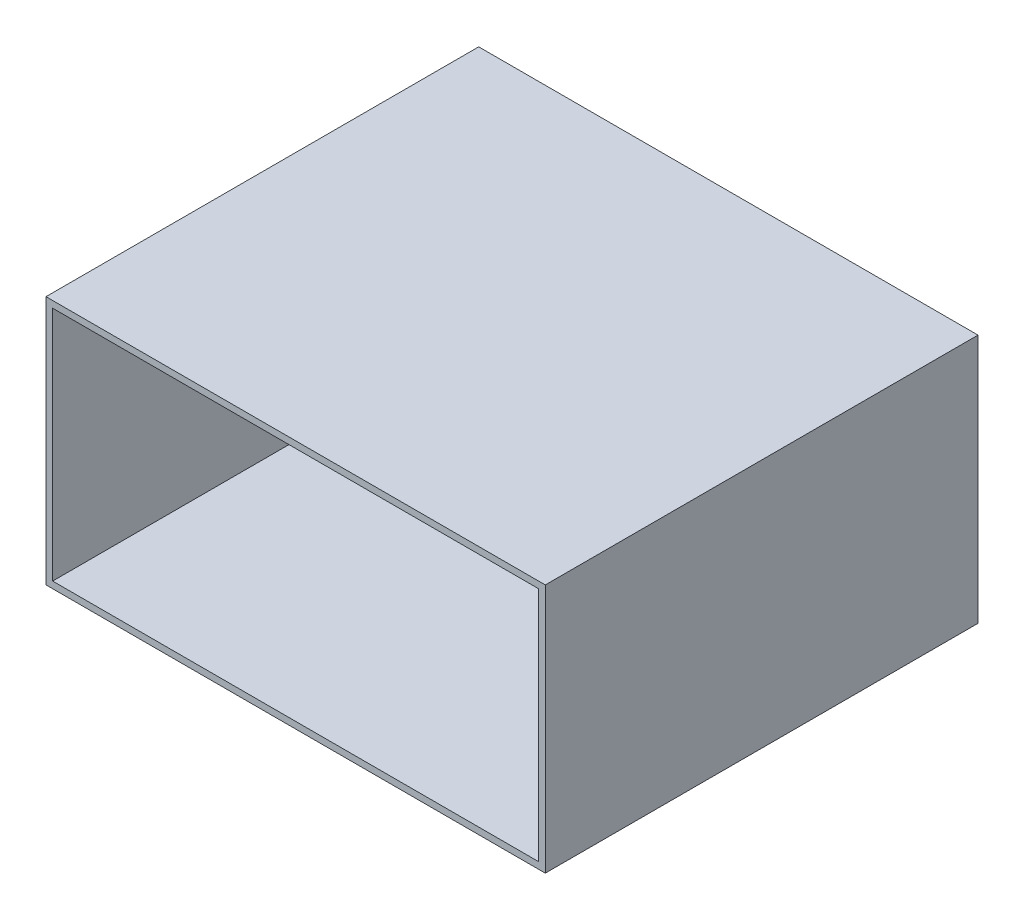
ISO-10303-21;
HEADER;
FILE_DESCRIPTION(('STEP AP214'),'2;1');
FILE_NAME('part.step','',(''),(''),'','','');
FILE_SCHEMA(('AUTOMOTIVE_DESIGN { 1 0 10303 214 1 1 1 1 }'));
ENDSEC;
DATA;
#1=APPLICATION_CONTEXT('core data for automotive mechanical design processes');
#2=APPLICATION_PROTOCOL_DEFINITION('international standard','automotive_design',2000,#1);
#3=PRODUCT_CONTEXT('',#1,'mechanical');
#4=PRODUCT('Part','Part','',(#3));
#5=PRODUCT_RELATED_PRODUCT_CATEGORY('part','',(#4));
#6=PRODUCT_DEFINITION_FORMATION('','',#4);
#7=PRODUCT_DEFINITION_CONTEXT('part definition',#1,'design');
#8=PRODUCT_DEFINITION('design','',#6,#7);
#9=PRODUCT_DEFINITION_SHAPE('','',#8);
#10=(LENGTH_UNIT() NAMED_UNIT(*) SI_UNIT(.MILLI.,.METRE.));
#11=(NAMED_UNIT(*) PLANE_ANGLE_UNIT() SI_UNIT($,.RADIAN.));
#12=(NAMED_UNIT(*) SI_UNIT($,.STERADIAN.) SOLID_ANGLE_UNIT());
#13=UNCERTAINTY_MEASURE_WITH_UNIT(LENGTH_MEASURE(1.E-05),#10,'distance_accuracy_value','');
#14=(GEOMETRIC_REPRESENTATION_CONTEXT(3) GLOBAL_UNCERTAINTY_ASSIGNED_CONTEXT((#13)) GLOBAL_UNIT_ASSIGNED_CONTEXT((#10,
#11,#12)) REPRESENTATION_CONTEXT('',''));
#15=CARTESIAN_POINT('',(0.,0.,0.));
#16=DIRECTION('',(0.,0.,1.));
#17=DIRECTION('',(1.,0.,0.));
#18=AXIS2_PLACEMENT_3D('',#15,#16,#17);
#19=CARTESIAN_POINT('',(0.,0.,650.));
#20=DIRECTION('',(0.,0.,-1.));
#21=DIRECTION('',(-1.,0.,0.));
#22=AXIS2_PLACEMENT_3D('',#19,#20,#21);
#23=PLANE('',#22);
#24=DIRECTION('',(0.,1.,0.));
#25=VECTOR('',#24,1.);
#26=CARTESIAN_POINT('',(375.,-187.5,650.));
#27=LINE('',#26,#25);
#28=CARTESIAN_POINT('',(375.,-187.5,650.));
#29=VERTEX_POINT('',#28);
#30=CARTESIAN_POINT('',(375.,187.5,650.));
#31=VERTEX_POINT('',#30);
#32=EDGE_CURVE('E153',#29,#31,#27,.T.);
#33=ORIENTED_EDGE('',*,*,#32,.T.);
#34=DIRECTION('',(-1.,0.,0.));
#35=VECTOR('',#34,1.);
#36=CARTESIAN_POINT('',(-375.,187.5,650.));
#37=LINE('',#36,#35);
#38=CARTESIAN_POINT('',(-375.,187.5,650.));
#39=VERTEX_POINT('',#38);
#40=EDGE_CURVE('E157',#31,#39,#37,.T.);
#41=ORIENTED_EDGE('',*,*,#40,.T.);
#42=DIRECTION('',(0.,-1.,0.));
#43=VECTOR('',#42,1.);
#44=CARTESIAN_POINT('',(-375.,-187.5,650.));
#45=LINE('',#44,#43);
#46=CARTESIAN_POINT('',(-375.,-187.5,650.));
#47=VERTEX_POINT('',#46);
#48=EDGE_CURVE('E161',#39,#47,#45,.T.);
#49=ORIENTED_EDGE('',*,*,#48,.T.);
#50=DIRECTION('',(1.,0.,0.));
#51=VECTOR('',#50,1.);
#52=CARTESIAN_POINT('',(-375.,-187.5,650.));
#53=LINE('',#52,#51);
#54=EDGE_CURVE('E164',#47,#29,#53,.T.);
#55=ORIENTED_EDGE('',*,*,#54,.T.);
#56=EDGE_LOOP('',(#33,#41,#49,#55));
#57=FACE_BOUND('',#56,.T.);
#58=DIRECTION('',(0.,-1.,0.));
#59=VECTOR('',#58,1.);
#60=CARTESIAN_POINT('',(-365.,-177.5,650.));
#61=LINE('',#60,#59);
#62=CARTESIAN_POINT('',(-365.,177.5,650.));
#63=VERTEX_POINT('',#62);
#64=CARTESIAN_POINT('',(-365.,-177.5,650.));
#65=VERTEX_POINT('',#64);
#66=EDGE_CURVE('E105',#63,#65,#61,.T.);
#67=ORIENTED_EDGE('',*,*,#66,.F.);
#68=DIRECTION('',(-1.,0.,0.));
#69=VECTOR('',#68,1.);
#70=CARTESIAN_POINT('',(-365.,177.5,650.));
#71=LINE('',#70,#69);
#72=CARTESIAN_POINT('',(365.,177.5,650.));
#73=VERTEX_POINT('',#72);
#74=EDGE_CURVE('E131',#73,#63,#71,.T.);
#75=ORIENTED_EDGE('',*,*,#74,.F.);
#76=DIRECTION('',(0.,1.,0.));
#77=VECTOR('',#76,1.);
#78=CARTESIAN_POINT('',(365.,-177.5,650.));
#79=LINE('',#78,#77);
#80=CARTESIAN_POINT('',(365.,-177.5,650.));
#81=VERTEX_POINT('',#80);
#82=EDGE_CURVE('E127',#81,#73,#79,.T.);
#83=ORIENTED_EDGE('',*,*,#82,.F.);
#84=DIRECTION('',(1.,0.,0.));
#85=VECTOR('',#84,1.);
#86=CARTESIAN_POINT('',(-365.,-177.5,650.));
#87=LINE('',#86,#85);
#88=EDGE_CURVE('E114',#65,#81,#87,.T.);
#89=ORIENTED_EDGE('',*,*,#88,.F.);
#90=EDGE_LOOP('',(#67,#75,#83,#89));
#91=FACE_BOUND('',#90,.T.);
#92=ADVANCED_FACE('F39',(#57,#91),#23,.F.);
#93=CARTESIAN_POINT('',(0.,0.,0.));
#94=DIRECTION('',(0.,0.,-1.));
#95=DIRECTION('',(-1.,0.,0.));
#96=AXIS2_PLACEMENT_3D('',#93,#94,#95);
#97=PLANE('',#96);
#98=DIRECTION('',(0.,1.,0.));
#99=VECTOR('',#98,1.);
#100=CARTESIAN_POINT('',(375.,-187.5,0.));
#101=LINE('',#100,#99);
#102=CARTESIAN_POINT('',(375.,-187.5,0.));
#103=VERTEX_POINT('',#102);
#104=CARTESIAN_POINT('',(375.,187.5,0.));
#105=VERTEX_POINT('',#104);
#106=EDGE_CURVE('E123',#103,#105,#101,.T.);
#107=ORIENTED_EDGE('',*,*,#106,.F.);
#108=DIRECTION('',(1.,0.,0.));
#109=VECTOR('',#108,1.);
#110=CARTESIAN_POINT('',(-375.,-187.5,0.));
#111=LINE('',#110,#109);
#112=CARTESIAN_POINT('',(-375.,-187.5,0.));
#113=VERTEX_POINT('',#112);
#114=EDGE_CURVE('E158',#113,#103,#111,.T.);
#115=ORIENTED_EDGE('',*,*,#114,.F.);
#116=DIRECTION('',(0.,-1.,0.));
#117=VECTOR('',#116,1.);
#118=CARTESIAN_POINT('',(-375.,-187.5,0.));
#119=LINE('',#118,#117);
#120=CARTESIAN_POINT('',(-375.,187.5,0.));
#121=VERTEX_POINT('',#120);
#122=EDGE_CURVE('E174',#121,#113,#119,.T.);
#123=ORIENTED_EDGE('',*,*,#122,.F.);
#124=DIRECTION('',(-1.,0.,0.));
#125=VECTOR('',#124,1.);
#126=CARTESIAN_POINT('',(-375.,187.5,0.));
#127=LINE('',#126,#125);
#128=EDGE_CURVE('E171',#105,#121,#127,.T.);
#129=ORIENTED_EDGE('',*,*,#128,.F.);
#130=EDGE_LOOP('',(#107,#115,#123,#129));
#131=FACE_BOUND('',#130,.T.);
#132=DIRECTION('',(-1.,0.,0.));
#133=VECTOR('',#132,1.);
#134=CARTESIAN_POINT('',(-365.,177.5,0.));
#135=LINE('',#134,#133);
#136=CARTESIAN_POINT('',(365.,177.5,0.));
#137=VERTEX_POINT('',#136);
#138=CARTESIAN_POINT('',(-365.,177.5,0.));
#139=VERTEX_POINT('',#138);
#140=EDGE_CURVE('E115',#137,#139,#135,.T.);
#141=ORIENTED_EDGE('',*,*,#140,.T.);
#142=DIRECTION('',(0.,-1.,0.));
#143=VECTOR('',#142,1.);
#144=CARTESIAN_POINT('',(-365.,-177.5,0.));
#145=LINE('',#144,#143);
#146=CARTESIAN_POINT('',(-365.,-177.5,0.));
#147=VERTEX_POINT('',#146);
#148=EDGE_CURVE('E63',#139,#147,#145,.T.);
#149=ORIENTED_EDGE('',*,*,#148,.T.);
#150=DIRECTION('',(1.,0.,0.));
#151=VECTOR('',#150,1.);
#152=CARTESIAN_POINT('',(-365.,-177.5,0.));
#153=LINE('',#152,#151);
#154=CARTESIAN_POINT('',(365.,-177.5,0.));
#155=VERTEX_POINT('',#154);
#156=EDGE_CURVE('E121',#147,#155,#153,.T.);
#157=ORIENTED_EDGE('',*,*,#156,.T.);
#158=DIRECTION('',(0.,1.,0.));
#159=VECTOR('',#158,1.);
#160=CARTESIAN_POINT('',(365.,-177.5,0.));
#161=LINE('',#160,#159);
#162=EDGE_CURVE('E140',#155,#137,#161,.T.);
#163=ORIENTED_EDGE('',*,*,#162,.T.);
#164=EDGE_LOOP('',(#141,#149,#157,#163));
#165=FACE_BOUND('',#164,.T.);
#166=ADVANCED_FACE('F197',(#131,#165),#97,.T.);
#167=CARTESIAN_POINT('',(375.,-187.5,650.));
#168=DIRECTION('',(-1.,0.,0.));
#169=DIRECTION('',(0.,0.,1.));
#170=AXIS2_PLACEMENT_3D('',#167,#168,#169);
#171=PLANE('',#170);
#172=ORIENTED_EDGE('',*,*,#106,.T.);
#173=DIRECTION('',(0.,0.,-1.));
#174=VECTOR('',#173,1.);
#175=CARTESIAN_POINT('',(375.,187.5,650.));
#176=LINE('',#175,#174);
#177=EDGE_CURVE('E11',#31,#105,#176,.T.);
#178=ORIENTED_EDGE('',*,*,#177,.F.);
#179=ORIENTED_EDGE('',*,*,#32,.F.);
#180=DIRECTION('',(0.,0.,-1.));
#181=VECTOR('',#180,1.);
#182=CARTESIAN_POINT('',(375.,-187.5,650.));
#183=LINE('',#182,#181);
#184=EDGE_CURVE('E167',#29,#103,#183,.T.);
#185=ORIENTED_EDGE('',*,*,#184,.T.);
#186=EDGE_LOOP('',(#172,#178,#179,#185));
#187=FACE_BOUND('',#186,.T.);
#188=ADVANCED_FACE('F41',(#187),#171,.F.);
#189=CARTESIAN_POINT('',(-375.,187.5,650.));
#190=DIRECTION('',(0.,-1.,0.));
#191=DIRECTION('',(0.,0.,-1.));
#192=AXIS2_PLACEMENT_3D('',#189,#190,#191);
#193=PLANE('',#192);
#194=ORIENTED_EDGE('',*,*,#128,.T.);
#195=DIRECTION('',(0.,0.,-1.));
#196=VECTOR('',#195,1.);
#197=CARTESIAN_POINT('',(-375.,187.5,650.));
#198=LINE('',#197,#196);
#199=EDGE_CURVE('E48',#39,#121,#198,.T.);
#200=ORIENTED_EDGE('',*,*,#199,.F.);
#201=ORIENTED_EDGE('',*,*,#40,.F.);
#202=ORIENTED_EDGE('',*,*,#177,.T.);
#203=EDGE_LOOP('',(#194,#200,#201,#202));
#204=FACE_BOUND('',#203,.T.);
#205=ADVANCED_FACE('F207',(#204),#193,.F.);
#206=CARTESIAN_POINT('',(-375.,-187.5,650.));
#207=DIRECTION('',(1.,0.,0.));
#208=DIRECTION('',(0.,0.,-1.));
#209=AXIS2_PLACEMENT_3D('',#206,#207,#208);
#210=PLANE('',#209);
#211=ORIENTED_EDGE('',*,*,#122,.T.);
#212=DIRECTION('',(0.,0.,-1.));
#213=VECTOR('',#212,1.);
#214=CARTESIAN_POINT('',(-375.,-187.5,650.));
#215=LINE('',#214,#213);
#216=EDGE_CURVE('E182',#47,#113,#215,.T.);
#217=ORIENTED_EDGE('',*,*,#216,.F.);
#218=ORIENTED_EDGE('',*,*,#48,.F.);
#219=ORIENTED_EDGE('',*,*,#199,.T.);
#220=EDGE_LOOP('',(#211,#217,#218,#219));
#221=FACE_BOUND('',#220,.T.);
#222=ADVANCED_FACE('F191',(#221),#210,.F.);
#223=CARTESIAN_POINT('',(-375.,-187.5,650.));
#224=DIRECTION('',(0.,1.,0.));
#225=DIRECTION('',(0.,0.,1.));
#226=AXIS2_PLACEMENT_3D('',#223,#224,#225);
#227=PLANE('',#226);
#228=ORIENTED_EDGE('',*,*,#114,.T.);
#229=ORIENTED_EDGE('',*,*,#184,.F.);
#230=ORIENTED_EDGE('',*,*,#54,.F.);
#231=ORIENTED_EDGE('',*,*,#216,.T.);
#232=EDGE_LOOP('',(#228,#229,#230,#231));
#233=FACE_BOUND('',#232,.T.);
#234=ADVANCED_FACE('F201',(#233),#227,.F.);
#235=CARTESIAN_POINT('',(-365.,-177.5,650.));
#236=DIRECTION('',(1.,0.,0.));
#237=DIRECTION('',(0.,0.,-1.));
#238=AXIS2_PLACEMENT_3D('',#235,#236,#237);
#239=PLANE('',#238);
#240=ORIENTED_EDGE('',*,*,#148,.F.);
#241=DIRECTION('',(0.,0.,-1.));
#242=VECTOR('',#241,1.);
#243=CARTESIAN_POINT('',(-365.,177.5,650.));
#244=LINE('',#243,#242);
#245=EDGE_CURVE('E109',#63,#139,#244,.T.);
#246=ORIENTED_EDGE('',*,*,#245,.F.);
#247=ORIENTED_EDGE('',*,*,#66,.T.);
#248=DIRECTION('',(0.,0.,-1.));
#249=VECTOR('',#248,1.);
#250=CARTESIAN_POINT('',(-365.,-177.5,650.));
#251=LINE('',#250,#249);
#252=EDGE_CURVE('E108',#65,#147,#251,.T.);
#253=ORIENTED_EDGE('',*,*,#252,.T.);
#254=EDGE_LOOP('',(#240,#246,#247,#253));
#255=FACE_BOUND('',#254,.T.);
#256=ADVANCED_FACE('F107',(#255),#239,.T.);
#257=CARTESIAN_POINT('',(-365.,-177.5,650.));
#258=DIRECTION('',(0.,1.,0.));
#259=DIRECTION('',(0.,0.,1.));
#260=AXIS2_PLACEMENT_3D('',#257,#258,#259);
#261=PLANE('',#260);
#262=ORIENTED_EDGE('',*,*,#156,.F.);
#263=ORIENTED_EDGE('',*,*,#252,.F.);
#264=ORIENTED_EDGE('',*,*,#88,.T.);
#265=DIRECTION('',(0.,0.,-1.));
#266=VECTOR('',#265,1.);
#267=CARTESIAN_POINT('',(365.,-177.5,650.));
#268=LINE('',#267,#266);
#269=EDGE_CURVE('E124',#81,#155,#268,.T.);
#270=ORIENTED_EDGE('',*,*,#269,.T.);
#271=EDGE_LOOP('',(#262,#263,#264,#270));
#272=FACE_BOUND('',#271,.T.);
#273=ADVANCED_FACE('F118',(#272),#261,.T.);
#274=CARTESIAN_POINT('',(365.,-177.5,650.));
#275=DIRECTION('',(-1.,0.,0.));
#276=DIRECTION('',(0.,0.,1.));
#277=AXIS2_PLACEMENT_3D('',#274,#275,#276);
#278=PLANE('',#277);
#279=ORIENTED_EDGE('',*,*,#162,.F.);
#280=ORIENTED_EDGE('',*,*,#269,.F.);
#281=ORIENTED_EDGE('',*,*,#82,.T.);
#282=DIRECTION('',(0.,0.,-1.));
#283=VECTOR('',#282,1.);
#284=CARTESIAN_POINT('',(365.,177.5,650.));
#285=LINE('',#284,#283);
#286=EDGE_CURVE('E55',#73,#137,#285,.T.);
#287=ORIENTED_EDGE('',*,*,#286,.T.);
#288=EDGE_LOOP('',(#279,#280,#281,#287));
#289=FACE_BOUND('',#288,.T.);
#290=ADVANCED_FACE('F230',(#289),#278,.T.);
#291=CARTESIAN_POINT('',(-365.,177.5,650.));
#292=DIRECTION('',(0.,-1.,0.));
#293=DIRECTION('',(0.,0.,-1.));
#294=AXIS2_PLACEMENT_3D('',#291,#292,#293);
#295=PLANE('',#294);
#296=ORIENTED_EDGE('',*,*,#140,.F.);
#297=ORIENTED_EDGE('',*,*,#286,.F.);
#298=ORIENTED_EDGE('',*,*,#74,.T.);
#299=ORIENTED_EDGE('',*,*,#245,.T.);
#300=EDGE_LOOP('',(#296,#297,#298,#299));
#301=FACE_BOUND('',#300,.T.);
#302=ADVANCED_FACE('F234',(#301),#295,.T.);
#303=CLOSED_SHELL('',(#92,#166,#188,#205,#222,#234,#256,#273,#290,#302));
#304=MANIFOLD_SOLID_BREP('B2',#303);
#305=ADVANCED_BREP_SHAPE_REPRESENTATION('',(#18,#304),#14);
#306=SHAPE_DEFINITION_REPRESENTATION(#9,#305);
ENDSEC;
END-ISO-10303-21;
